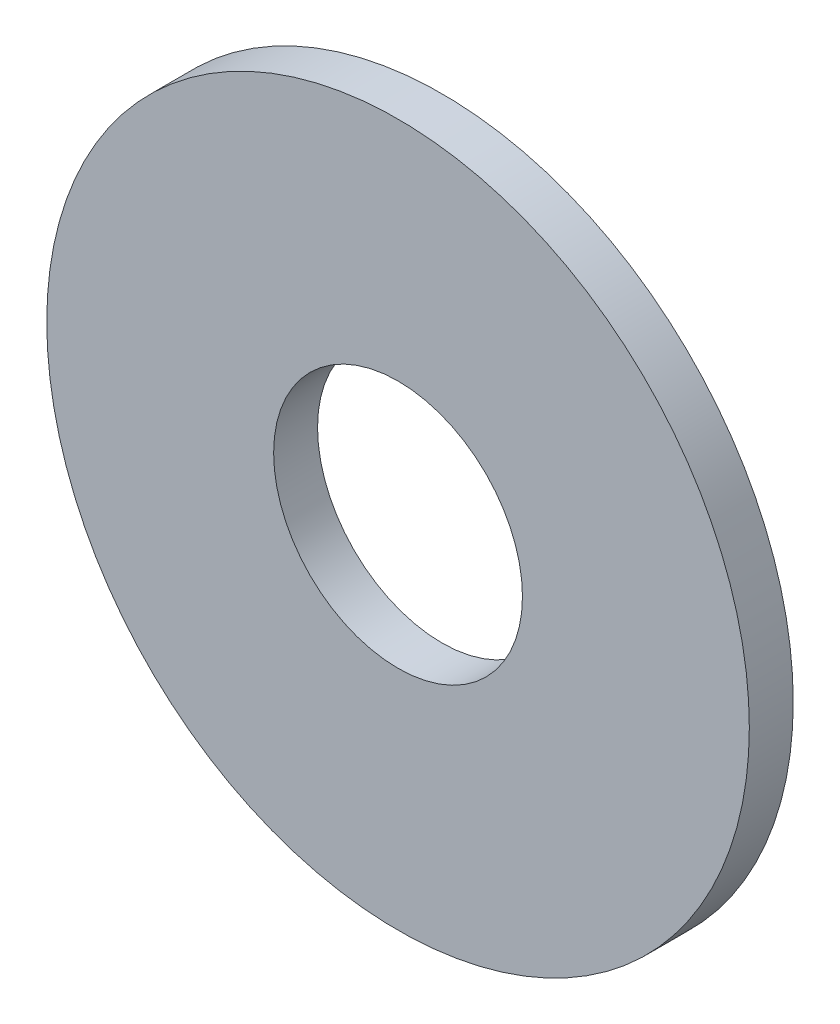
ISO-10303-21;
HEADER;
FILE_DESCRIPTION(('STEP AP214'),'2;1');
FILE_NAME('part.step','',(''),(''),'','','');
FILE_SCHEMA(('AUTOMOTIVE_DESIGN { 1 0 10303 214 1 1 1 1 }'));
ENDSEC;
DATA;
#1=APPLICATION_CONTEXT('core data for automotive mechanical design processes');
#2=APPLICATION_PROTOCOL_DEFINITION('international standard','automotive_design',2000,#1);
#3=PRODUCT_CONTEXT('',#1,'mechanical');
#4=PRODUCT('Part','Part','',(#3));
#5=PRODUCT_RELATED_PRODUCT_CATEGORY('part','',(#4));
#6=PRODUCT_DEFINITION_FORMATION('','',#4);
#7=PRODUCT_DEFINITION_CONTEXT('part definition',#1,'design');
#8=PRODUCT_DEFINITION('design','',#6,#7);
#9=PRODUCT_DEFINITION_SHAPE('','',#8);
#10=(LENGTH_UNIT() NAMED_UNIT(*) SI_UNIT(.MILLI.,.METRE.));
#11=(NAMED_UNIT(*) PLANE_ANGLE_UNIT() SI_UNIT($,.RADIAN.));
#12=(NAMED_UNIT(*) SI_UNIT($,.STERADIAN.) SOLID_ANGLE_UNIT());
#13=UNCERTAINTY_MEASURE_WITH_UNIT(LENGTH_MEASURE(1.E-05),#10,'distance_accuracy_value','');
#14=(GEOMETRIC_REPRESENTATION_CONTEXT(3) GLOBAL_UNCERTAINTY_ASSIGNED_CONTEXT((#13)) GLOBAL_UNIT_ASSIGNED_CONTEXT((#10,
#11,#12)) REPRESENTATION_CONTEXT('',''));
#15=CARTESIAN_POINT('',(0.,0.,0.));
#16=DIRECTION('',(0.,0.,1.));
#17=DIRECTION('',(1.,0.,0.));
#18=AXIS2_PLACEMENT_3D('',#15,#16,#17);
#19=CARTESIAN_POINT('',(0.,0.,3.));
#20=DIRECTION('',(0.,0.,1.));
#21=DIRECTION('',(1.,0.,0.));
#22=AXIS2_PLACEMENT_3D('',#19,#20,#21);
#23=PLANE('',#22);
#24=CARTESIAN_POINT('',(0.,0.,3.));
#25=DIRECTION('',(0.,0.,1.));
#26=DIRECTION('',(1.,0.,0.));
#27=AXIS2_PLACEMENT_3D('',#24,#25,#26);
#28=CIRCLE('',#27,24.);
#29=CARTESIAN_POINT('',(24.,0.,3.));
#30=VERTEX_POINT('',#29);
#31=EDGE_CURVE('E10',#30,#30,#28,.T.);
#32=ORIENTED_EDGE('',*,*,#31,.T.);
#33=EDGE_LOOP('',(#32));
#34=FACE_BOUND('',#33,.T.);
#35=CARTESIAN_POINT('',(0.,0.,3.));
#36=DIRECTION('',(0.,0.,1.));
#37=DIRECTION('',(1.,0.,0.));
#38=AXIS2_PLACEMENT_3D('',#35,#36,#37);
#39=CIRCLE('',#38,8.5);
#40=CARTESIAN_POINT('',(8.5,0.,3.));
#41=VERTEX_POINT('',#40);
#42=EDGE_CURVE('E43',#41,#41,#39,.T.);
#43=ORIENTED_EDGE('',*,*,#42,.F.);
#44=EDGE_LOOP('',(#43));
#45=FACE_BOUND('',#44,.T.);
#46=ADVANCED_FACE('F32',(#34,#45),#23,.T.);
#47=CARTESIAN_POINT('',(0.,0.,0.));
#48=DIRECTION('',(0.,0.,1.));
#49=DIRECTION('',(1.,0.,0.));
#50=AXIS2_PLACEMENT_3D('',#47,#48,#49);
#51=PLANE('',#50);
#52=CARTESIAN_POINT('',(0.,0.,0.));
#53=DIRECTION('',(0.,0.,1.));
#54=DIRECTION('',(1.,0.,0.));
#55=AXIS2_PLACEMENT_3D('',#52,#53,#54);
#56=CIRCLE('',#55,24.);
#57=CARTESIAN_POINT('',(24.,0.,0.));
#58=VERTEX_POINT('',#57);
#59=EDGE_CURVE('E36',#58,#58,#56,.T.);
#60=ORIENTED_EDGE('',*,*,#59,.F.);
#61=EDGE_LOOP('',(#60));
#62=FACE_BOUND('',#61,.T.);
#63=CARTESIAN_POINT('',(0.,0.,0.));
#64=DIRECTION('',(0.,0.,1.));
#65=DIRECTION('',(1.,0.,0.));
#66=AXIS2_PLACEMENT_3D('',#63,#64,#65);
#67=CIRCLE('',#66,8.5);
#68=CARTESIAN_POINT('',(8.5,0.,0.));
#69=VERTEX_POINT('',#68);
#70=EDGE_CURVE('E45',#69,#69,#67,.T.);
#71=ORIENTED_EDGE('',*,*,#70,.T.);
#72=EDGE_LOOP('',(#71));
#73=FACE_BOUND('',#72,.T.);
#74=ADVANCED_FACE('F55',(#62,#73),#51,.F.);
#75=CARTESIAN_POINT('',(0.,0.,3.));
#76=DIRECTION('',(0.,0.,-1.));
#77=DIRECTION('',(-1.,0.,0.));
#78=AXIS2_PLACEMENT_3D('',#75,#76,#77);
#79=CYLINDRICAL_SURFACE('',#78,24.);
#80=ORIENTED_EDGE('',*,*,#31,.F.);
#81=EDGE_LOOP('',(#80));
#82=FACE_BOUND('',#81,.T.);
#83=ORIENTED_EDGE('',*,*,#59,.T.);
#84=EDGE_LOOP('',(#83));
#85=FACE_BOUND('',#84,.T.);
#86=ADVANCED_FACE('F34',(#82,#85),#79,.T.);
#87=CARTESIAN_POINT('',(0.,0.,3.));
#88=DIRECTION('',(0.,0.,-1.));
#89=DIRECTION('',(-1.,0.,0.));
#90=AXIS2_PLACEMENT_3D('',#87,#88,#89);
#91=CYLINDRICAL_SURFACE('',#90,8.5);
#92=ORIENTED_EDGE('',*,*,#42,.T.);
#93=EDGE_LOOP('',(#92));
#94=FACE_BOUND('',#93,.T.);
#95=ORIENTED_EDGE('',*,*,#70,.F.);
#96=EDGE_LOOP('',(#95));
#97=FACE_BOUND('',#96,.T.);
#98=ADVANCED_FACE('F51',(#94,#97),#91,.F.);
#99=CLOSED_SHELL('',(#46,#74,#86,#98));
#100=MANIFOLD_SOLID_BREP('B2',#99);
#101=ADVANCED_BREP_SHAPE_REPRESENTATION('',(#18,#100),#14);
#102=SHAPE_DEFINITION_REPRESENTATION(#9,#101);
ENDSEC;
END-ISO-10303-21;
